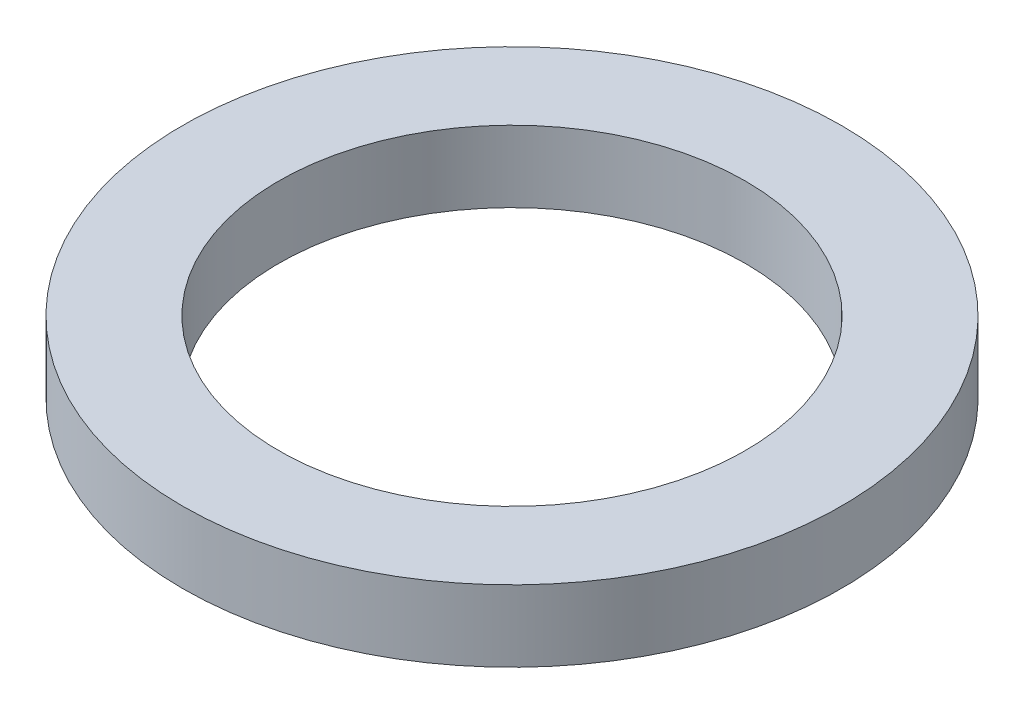
ISO-10303-21;
HEADER;
FILE_DESCRIPTION(('STEP AP214'),'2;1');
FILE_NAME('part.step','',(''),(''),'','','');
FILE_SCHEMA(('AUTOMOTIVE_DESIGN { 1 0 10303 214 1 1 1 1 }'));
ENDSEC;
DATA;
#1=APPLICATION_CONTEXT('core data for automotive mechanical design processes');
#2=APPLICATION_PROTOCOL_DEFINITION('international standard','automotive_design',2000,#1);
#3=PRODUCT_CONTEXT('',#1,'mechanical');
#4=PRODUCT('Part','Part','',(#3));
#5=PRODUCT_RELATED_PRODUCT_CATEGORY('part','',(#4));
#6=PRODUCT_DEFINITION_FORMATION('','',#4);
#7=PRODUCT_DEFINITION_CONTEXT('part definition',#1,'design');
#8=PRODUCT_DEFINITION('design','',#6,#7);
#9=PRODUCT_DEFINITION_SHAPE('','',#8);
#10=(LENGTH_UNIT() NAMED_UNIT(*) SI_UNIT(.MILLI.,.METRE.));
#11=(NAMED_UNIT(*) PLANE_ANGLE_UNIT() SI_UNIT($,.RADIAN.));
#12=(NAMED_UNIT(*) SI_UNIT($,.STERADIAN.) SOLID_ANGLE_UNIT());
#13=UNCERTAINTY_MEASURE_WITH_UNIT(LENGTH_MEASURE(1.E-05),#10,'distance_accuracy_value','');
#14=(GEOMETRIC_REPRESENTATION_CONTEXT(3) GLOBAL_UNCERTAINTY_ASSIGNED_CONTEXT((#13)) GLOBAL_UNIT_ASSIGNED_CONTEXT((#10,
#11,#12)) REPRESENTATION_CONTEXT('',''));
#15=CARTESIAN_POINT('',(0.,0.,0.));
#16=DIRECTION('',(0.,0.,1.));
#17=DIRECTION('',(1.,0.,0.));
#18=AXIS2_PLACEMENT_3D('',#15,#16,#17);
#19=CARTESIAN_POINT('',(0.,13.,0.));
#20=DIRECTION('',(0.,-1.,0.));
#21=DIRECTION('',(0.,0.,-1.));
#22=AXIS2_PLACEMENT_3D('',#19,#20,#21);
#23=CYLINDRICAL_SURFACE('',#22,60.);
#24=CARTESIAN_POINT('',(0.,13.,0.));
#25=DIRECTION('',(0.,1.,0.));
#26=DIRECTION('',(0.,0.,1.));
#27=AXIS2_PLACEMENT_3D('',#24,#25,#26);
#28=CIRCLE('',#27,60.);
#29=CARTESIAN_POINT('',(0.,13.,-60.));
#30=VERTEX_POINT('',#29);
#31=EDGE_CURVE('E10',#30,#30,#28,.T.);
#32=CARTESIAN_POINT('',(0.,0.,0.));
#33=DIRECTION('',(0.,1.,0.));
#34=DIRECTION('',(0.,0.,1.));
#35=AXIS2_PLACEMENT_3D('',#32,#33,#34);
#36=CIRCLE('',#35,60.);
#37=CARTESIAN_POINT('',(0.,0.,-60.));
#38=VERTEX_POINT('',#37);
#39=EDGE_CURVE('E37',#38,#38,#36,.T.);
#40=CARTESIAN_POINT('',(0.,13.,-60.));
#41=CARTESIAN_POINT('',(0.,12.8645833333333,-60.));
#42=CARTESIAN_POINT('',(0.,12.7291666666667,-60.));
#43=CARTESIAN_POINT('',(0.,12.4583333333333,-60.));
#44=CARTESIAN_POINT('',(0.,12.3229166666667,-60.));
#45=CARTESIAN_POINT('',(0.,12.0520833333333,-60.));
#46=CARTESIAN_POINT('',(0.,11.9166666666667,-60.));
#47=CARTESIAN_POINT('',(0.,11.6458333333333,-60.));
#48=CARTESIAN_POINT('',(0.,11.5104166666667,-60.));
#49=CARTESIAN_POINT('',(0.,11.2395833333333,-60.));
#50=CARTESIAN_POINT('',(0.,11.1041666666667,-60.));
#51=CARTESIAN_POINT('',(0.,10.8333333333333,-60.));
#52=CARTESIAN_POINT('',(0.,10.6979166666667,-60.));
#53=CARTESIAN_POINT('',(0.,10.4270833333333,-60.));
#54=CARTESIAN_POINT('',(0.,10.2916666666667,-60.));
#55=CARTESIAN_POINT('',(0.,10.0208333333333,-60.));
#56=CARTESIAN_POINT('',(0.,9.88541666666667,-60.));
#57=CARTESIAN_POINT('',(0.,9.61458333333333,-60.));
#58=CARTESIAN_POINT('',(0.,9.47916666666667,-60.));
#59=CARTESIAN_POINT('',(0.,9.20833333333333,-60.));
#60=CARTESIAN_POINT('',(0.,9.07291666666666,-60.));
#61=CARTESIAN_POINT('',(0.,8.80208333333333,-60.));
#62=CARTESIAN_POINT('',(0.,8.66666666666667,-60.));
#63=CARTESIAN_POINT('',(0.,8.39583333333333,-60.));
#64=CARTESIAN_POINT('',(0.,8.26041666666667,-60.));
#65=CARTESIAN_POINT('',(0.,7.98958333333333,-60.));
#66=CARTESIAN_POINT('',(0.,7.85416666666667,-60.));
#67=CARTESIAN_POINT('',(0.,7.58333333333333,-60.));
#68=CARTESIAN_POINT('',(0.,7.44791666666667,-60.));
#69=CARTESIAN_POINT('',(0.,7.17708333333333,-60.));
#70=CARTESIAN_POINT('',(0.,7.04166666666667,-60.));
#71=CARTESIAN_POINT('',(0.,6.77083333333333,-60.));
#72=CARTESIAN_POINT('',(0.,6.63541666666667,-60.));
#73=CARTESIAN_POINT('',(0.,6.36458333333333,-60.));
#74=CARTESIAN_POINT('',(0.,6.22916666666667,-60.));
#75=CARTESIAN_POINT('',(0.,5.95833333333333,-60.));
#76=CARTESIAN_POINT('',(0.,5.82291666666667,-60.));
#77=CARTESIAN_POINT('',(0.,5.55208333333333,-60.));
#78=CARTESIAN_POINT('',(0.,5.41666666666667,-60.));
#79=CARTESIAN_POINT('',(0.,5.14583333333333,-60.));
#80=CARTESIAN_POINT('',(0.,5.01041666666667,-60.));
#81=CARTESIAN_POINT('',(0.,4.73958333333333,-60.));
#82=CARTESIAN_POINT('',(0.,4.60416666666667,-60.));
#83=CARTESIAN_POINT('',(0.,4.33333333333333,-60.));
#84=CARTESIAN_POINT('',(0.,4.19791666666667,-60.));
#85=CARTESIAN_POINT('',(0.,3.92708333333333,-60.));
#86=CARTESIAN_POINT('',(0.,3.79166666666667,-60.));
#87=CARTESIAN_POINT('',(0.,3.52083333333333,-60.));
#88=CARTESIAN_POINT('',(0.,3.38541666666667,-60.));
#89=CARTESIAN_POINT('',(0.,3.11458333333333,-60.));
#90=CARTESIAN_POINT('',(0.,2.97916666666667,-60.));
#91=CARTESIAN_POINT('',(0.,2.70833333333333,-60.));
#92=CARTESIAN_POINT('',(0.,2.57291666666667,-60.));
#93=CARTESIAN_POINT('',(0.,2.30208333333333,-60.));
#94=CARTESIAN_POINT('',(0.,2.16666666666667,-60.));
#95=CARTESIAN_POINT('',(0.,1.89583333333333,-60.));
#96=CARTESIAN_POINT('',(0.,1.76041666666667,-60.));
#97=CARTESIAN_POINT('',(0.,1.48958333333333,-60.));
#98=CARTESIAN_POINT('',(0.,1.35416666666667,-60.));
#99=CARTESIAN_POINT('',(0.,1.08333333333333,-60.));
#100=CARTESIAN_POINT('',(0.,0.947916666666667,-60.));
#101=CARTESIAN_POINT('',(0.,0.677083333333334,-60.));
#102=CARTESIAN_POINT('',(0.,0.541666666666667,-60.));
#103=CARTESIAN_POINT('',(0.,0.270833333333334,-60.));
#104=CARTESIAN_POINT('',(0.,0.135416666666667,-60.));
#105=CARTESIAN_POINT('',(0.,0.,-60.));
#106=B_SPLINE_CURVE_WITH_KNOTS('',3,(#40,#41,#42,#43,#44,#45,#46,#47,#48,#49,#50,#51,#52,#53,
#54,#55,#56,#57,#58,#59,#60,#61,#62,#63,#64,#65,#66,#67,#68,#69,#70,#71,#72,#73,#74,#75,#76,#77,
#78,#79,#80,#81,#82,#83,#84,#85,#86,#87,#88,#89,#90,#91,#92,#93,#94,#95,#96,#97,#98,#99,#100,
#101,#102,#103,#104,#105),.UNSPECIFIED.,.F.,.F.,(4,2,2,2,2,2,2,2,2,2,2,2,2,2,2,2,2,2,2,2,2,2,2,
2,2,2,2,2,2,2,2,2,4),(0.,0.40625,0.812500000000001,1.21875,1.625,2.03125,2.4375,2.84375,3.25,
3.65625,4.0625,4.46875,4.875,5.28125,5.6875,6.09375,6.5,6.90625,7.3125,7.71875,8.125,8.53125,
8.9375,9.34375,9.75,10.15625,10.5625,10.96875,11.375,11.78125,12.1875,12.59375,13.),.UNSPECIFIED.);
#107=EDGE_CURVE('BSEAM40',#30,#38,#106,.T.);
#108=ORIENTED_EDGE('',*,*,#31,.F.);
#109=ORIENTED_EDGE('',*,*,#39,.T.);
#110=ORIENTED_EDGE('',*,*,#107,.T.);
#111=ORIENTED_EDGE('',*,*,#107,.F.);
#112=EDGE_LOOP('',(#108,#110,#109,#111));
#113=FACE_BOUND('',#112,.T.);
#114=ADVANCED_FACE('F40',(#113),#23,.T.);
#115=CARTESIAN_POINT('',(0.,13.,0.));
#116=DIRECTION('',(0.,1.,0.));
#117=DIRECTION('',(0.,0.,1.));
#118=AXIS2_PLACEMENT_3D('',#115,#116,#117);
#119=PLANE('',#118);
#120=CARTESIAN_POINT('',(0.,13.,0.));
#121=DIRECTION('',(0.,1.,0.));
#122=DIRECTION('',(0.,0.,1.));
#123=AXIS2_PLACEMENT_3D('',#120,#121,#122);
#124=CIRCLE('',#123,42.5);
#125=CARTESIAN_POINT('',(0.,13.,-42.5));
#126=VERTEX_POINT('',#125);
#127=EDGE_CURVE('E50',#126,#126,#124,.T.);
#128=ORIENTED_EDGE('',*,*,#127,.F.);
#129=EDGE_LOOP('',(#128));
#130=FACE_BOUND('',#129,.T.);
#131=ORIENTED_EDGE('',*,*,#31,.T.);
#132=EDGE_LOOP('',(#131));
#133=FACE_BOUND('',#132,.T.);
#134=ADVANCED_FACE('F59',(#130,#133),#119,.T.);
#135=CARTESIAN_POINT('',(0.,0.,0.));
#136=DIRECTION('',(0.,1.,0.));
#137=DIRECTION('',(0.,0.,1.));
#138=AXIS2_PLACEMENT_3D('',#135,#136,#137);
#139=PLANE('',#138);
#140=CARTESIAN_POINT('',(0.,0.,0.));
#141=DIRECTION('',(0.,1.,0.));
#142=DIRECTION('',(0.,0.,1.));
#143=AXIS2_PLACEMENT_3D('',#140,#141,#142);
#144=CIRCLE('',#143,42.5);
#145=CARTESIAN_POINT('',(0.,0.,-42.5));
#146=VERTEX_POINT('',#145);
#147=EDGE_CURVE('E47',#146,#146,#144,.T.);
#148=ORIENTED_EDGE('',*,*,#147,.T.);
#149=EDGE_LOOP('',(#148));
#150=FACE_BOUND('',#149,.T.);
#151=ORIENTED_EDGE('',*,*,#39,.F.);
#152=EDGE_LOOP('',(#151));
#153=FACE_BOUND('',#152,.T.);
#154=ADVANCED_FACE('F58',(#150,#153),#139,.F.);
#155=CARTESIAN_POINT('',(0.,13.,0.));
#156=DIRECTION('',(0.,-1.,0.));
#157=DIRECTION('',(0.,0.,-1.));
#158=AXIS2_PLACEMENT_3D('',#155,#156,#157);
#159=CYLINDRICAL_SURFACE('',#158,42.5);
#160=CARTESIAN_POINT('',(0.,13.,-42.5));
#161=CARTESIAN_POINT('',(0.,12.8645833333333,-42.5));
#162=CARTESIAN_POINT('',(0.,12.7291666666667,-42.5));
#163=CARTESIAN_POINT('',(0.,12.4583333333333,-42.5));
#164=CARTESIAN_POINT('',(0.,12.3229166666667,-42.5));
#165=CARTESIAN_POINT('',(0.,12.0520833333333,-42.5));
#166=CARTESIAN_POINT('',(0.,11.9166666666667,-42.5));
#167=CARTESIAN_POINT('',(0.,11.6458333333333,-42.5));
#168=CARTESIAN_POINT('',(0.,11.5104166666667,-42.5));
#169=CARTESIAN_POINT('',(0.,11.2395833333333,-42.5));
#170=CARTESIAN_POINT('',(0.,11.1041666666667,-42.5));
#171=CARTESIAN_POINT('',(0.,10.8333333333333,-42.5));
#172=CARTESIAN_POINT('',(0.,10.6979166666667,-42.5));
#173=CARTESIAN_POINT('',(0.,10.4270833333333,-42.5));
#174=CARTESIAN_POINT('',(0.,10.2916666666667,-42.5));
#175=CARTESIAN_POINT('',(0.,10.0208333333333,-42.5));
#176=CARTESIAN_POINT('',(0.,9.88541666666667,-42.5));
#177=CARTESIAN_POINT('',(0.,9.61458333333333,-42.5));
#178=CARTESIAN_POINT('',(0.,9.47916666666667,-42.5));
#179=CARTESIAN_POINT('',(0.,9.20833333333333,-42.5));
#180=CARTESIAN_POINT('',(0.,9.07291666666666,-42.5));
#181=CARTESIAN_POINT('',(0.,8.80208333333333,-42.5));
#182=CARTESIAN_POINT('',(0.,8.66666666666667,-42.5));
#183=CARTESIAN_POINT('',(0.,8.39583333333333,-42.5));
#184=CARTESIAN_POINT('',(0.,8.26041666666667,-42.5));
#185=CARTESIAN_POINT('',(0.,7.98958333333333,-42.5));
#186=CARTESIAN_POINT('',(0.,7.85416666666667,-42.5));
#187=CARTESIAN_POINT('',(0.,7.58333333333333,-42.5));
#188=CARTESIAN_POINT('',(0.,7.44791666666667,-42.5));
#189=CARTESIAN_POINT('',(0.,7.17708333333333,-42.5));
#190=CARTESIAN_POINT('',(0.,7.04166666666667,-42.5));
#191=CARTESIAN_POINT('',(0.,6.77083333333333,-42.5));
#192=CARTESIAN_POINT('',(0.,6.63541666666667,-42.5));
#193=CARTESIAN_POINT('',(0.,6.36458333333333,-42.5));
#194=CARTESIAN_POINT('',(0.,6.22916666666667,-42.5));
#195=CARTESIAN_POINT('',(0.,5.95833333333333,-42.5));
#196=CARTESIAN_POINT('',(0.,5.82291666666667,-42.5));
#197=CARTESIAN_POINT('',(0.,5.55208333333333,-42.5));
#198=CARTESIAN_POINT('',(0.,5.41666666666667,-42.5));
#199=CARTESIAN_POINT('',(0.,5.14583333333333,-42.5));
#200=CARTESIAN_POINT('',(0.,5.01041666666667,-42.5));
#201=CARTESIAN_POINT('',(0.,4.73958333333333,-42.5));
#202=CARTESIAN_POINT('',(0.,4.60416666666667,-42.5));
#203=CARTESIAN_POINT('',(0.,4.33333333333333,-42.5));
#204=CARTESIAN_POINT('',(0.,4.19791666666667,-42.5));
#205=CARTESIAN_POINT('',(0.,3.92708333333333,-42.5));
#206=CARTESIAN_POINT('',(0.,3.79166666666667,-42.5));
#207=CARTESIAN_POINT('',(0.,3.52083333333333,-42.5));
#208=CARTESIAN_POINT('',(0.,3.38541666666667,-42.5));
#209=CARTESIAN_POINT('',(0.,3.11458333333333,-42.5));
#210=CARTESIAN_POINT('',(0.,2.97916666666667,-42.5));
#211=CARTESIAN_POINT('',(0.,2.70833333333333,-42.5));
#212=CARTESIAN_POINT('',(0.,2.57291666666667,-42.5));
#213=CARTESIAN_POINT('',(0.,2.30208333333333,-42.5));
#214=CARTESIAN_POINT('',(0.,2.16666666666667,-42.5));
#215=CARTESIAN_POINT('',(0.,1.89583333333333,-42.5));
#216=CARTESIAN_POINT('',(0.,1.76041666666667,-42.5));
#217=CARTESIAN_POINT('',(0.,1.48958333333333,-42.5));
#218=CARTESIAN_POINT('',(0.,1.35416666666667,-42.5));
#219=CARTESIAN_POINT('',(0.,1.08333333333333,-42.5));
#220=CARTESIAN_POINT('',(0.,0.947916666666667,-42.5));
#221=CARTESIAN_POINT('',(0.,0.677083333333334,-42.5));
#222=CARTESIAN_POINT('',(0.,0.541666666666667,-42.5));
#223=CARTESIAN_POINT('',(0.,0.270833333333334,-42.5));
#224=CARTESIAN_POINT('',(0.,0.135416666666667,-42.5));
#225=CARTESIAN_POINT('',(0.,0.,-42.5));
#226=B_SPLINE_CURVE_WITH_KNOTS('',3,(#160,#161,#162,#163,#164,#165,#166,#167,#168,#169,#170,
#171,#172,#173,#174,#175,#176,#177,#178,#179,#180,#181,#182,#183,#184,#185,#186,#187,#188,#189,
#190,#191,#192,#193,#194,#195,#196,#197,#198,#199,#200,#201,#202,#203,#204,#205,#206,#207,#208,
#209,#210,#211,#212,#213,#214,#215,#216,#217,#218,#219,#220,#221,#222,#223,#224,#225),
.UNSPECIFIED.,.F.,.F.,(4,2,2,2,2,2,2,2,2,2,2,2,2,2,2,2,2,2,2,2,2,2,2,2,2,2,2,2,2,2,2,2,4),(0.,
0.40625,0.812500000000001,1.21875,1.625,2.03125,2.4375,2.84375,3.25,3.65625,4.0625,4.46875,
4.875,5.28125,5.6875,6.09375,6.5,6.90625,7.3125,7.71875,8.125,8.53125,8.9375,9.34375,9.75,
10.15625,10.5625,10.96875,11.375,11.78125,12.1875,12.59375,13.),.UNSPECIFIED.);
#227=EDGE_CURVE('BSEAM54',#126,#146,#226,.T.);
#228=ORIENTED_EDGE('',*,*,#127,.T.);
#229=ORIENTED_EDGE('',*,*,#147,.F.);
#230=ORIENTED_EDGE('',*,*,#227,.T.);
#231=ORIENTED_EDGE('',*,*,#227,.F.);
#232=EDGE_LOOP('',(#228,#230,#229,#231));
#233=FACE_BOUND('',#232,.T.);
#234=ADVANCED_FACE('F54',(#233),#159,.F.);
#235=CLOSED_SHELL('',(#114,#134,#154,#234));
#236=MANIFOLD_SOLID_BREP('B2',#235);
#237=ADVANCED_BREP_SHAPE_REPRESENTATION('',(#18,#236),#14);
#238=SHAPE_DEFINITION_REPRESENTATION(#9,#237);
ENDSEC;
END-ISO-10303-21;
